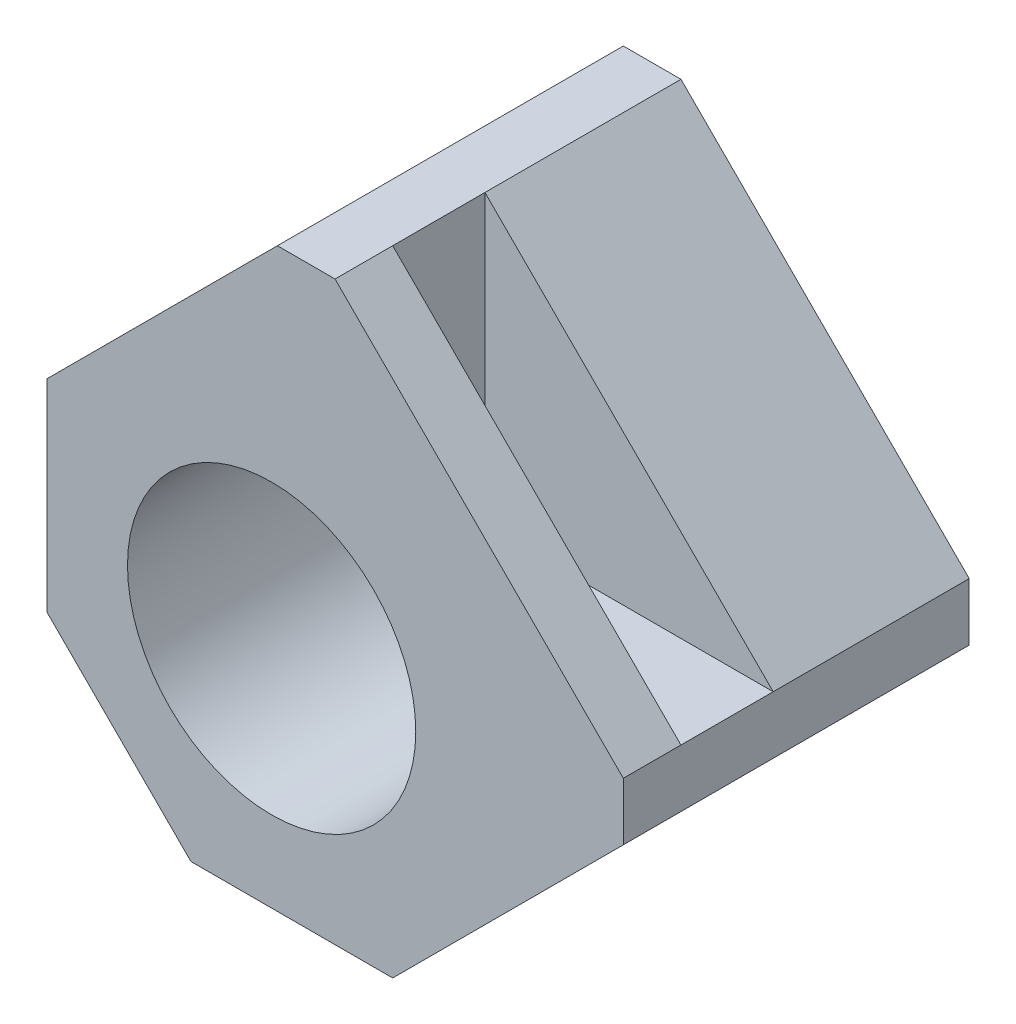
ISO-10303-21;
HEADER;
FILE_DESCRIPTION(('STEP AP214'),'2;1');
FILE_NAME('part.step','',(''),(''),'','','');
FILE_SCHEMA(('AUTOMOTIVE_DESIGN { 1 0 10303 214 1 1 1 1 }'));
ENDSEC;
DATA;
#1=APPLICATION_CONTEXT('core data for automotive mechanical design processes');
#2=APPLICATION_PROTOCOL_DEFINITION('international standard','automotive_design',2000,#1);
#3=PRODUCT_CONTEXT('',#1,'mechanical');
#4=PRODUCT('Part','Part','',(#3));
#5=PRODUCT_RELATED_PRODUCT_CATEGORY('part','',(#4));
#6=PRODUCT_DEFINITION_FORMATION('','',#4);
#7=PRODUCT_DEFINITION_CONTEXT('part definition',#1,'design');
#8=PRODUCT_DEFINITION('design','',#6,#7);
#9=PRODUCT_DEFINITION_SHAPE('','',#8);
#10=(LENGTH_UNIT() NAMED_UNIT(*) SI_UNIT(.MILLI.,.METRE.));
#11=(NAMED_UNIT(*) PLANE_ANGLE_UNIT() SI_UNIT($,.RADIAN.));
#12=(NAMED_UNIT(*) SI_UNIT($,.STERADIAN.) SOLID_ANGLE_UNIT());
#13=UNCERTAINTY_MEASURE_WITH_UNIT(LENGTH_MEASURE(1.E-05),#10,'distance_accuracy_value','');
#14=(GEOMETRIC_REPRESENTATION_CONTEXT(3) GLOBAL_UNCERTAINTY_ASSIGNED_CONTEXT((#13)) GLOBAL_UNIT_ASSIGNED_CONTEXT((#10,
#11,#12)) REPRESENTATION_CONTEXT('',''));
#15=CARTESIAN_POINT('',(0.,0.,0.));
#16=DIRECTION('',(0.,0.,1.));
#17=DIRECTION('',(1.,0.,0.));
#18=AXIS2_PLACEMENT_3D('',#15,#16,#17);
#19=CARTESIAN_POINT('',(7.80000000000001,7.79999999999997,12.));
#20=DIRECTION('',(0.,0.,-1.));
#21=DIRECTION('',(-1.,0.,0.));
#22=AXIS2_PLACEMENT_3D('',#19,#20,#21);
#23=CYLINDRICAL_SURFACE('',#22,2.2);
#24=CARTESIAN_POINT('',(7.80000000000001,7.79999999999997,1.5));
#25=DIRECTION('',(0.,0.,1.));
#26=DIRECTION('',(1.,0.,0.));
#27=AXIS2_PLACEMENT_3D('',#24,#25,#26);
#28=CIRCLE('',#27,2.2);
#29=CARTESIAN_POINT('',(10.,7.79999999999997,1.5));
#30=VERTEX_POINT('',#29);
#31=EDGE_CURVE('E194',#30,#30,#28,.F.);
#32=ORIENTED_EDGE('',*,*,#31,.F.);
#33=EDGE_LOOP('',(#32));
#34=FACE_BOUND('',#33,.T.);
#35=CARTESIAN_POINT('',(7.80000000000001,7.79999999999997,0.5));
#36=DIRECTION('',(0.,0.,-1.));
#37=DIRECTION('',(-1.,0.,0.));
#38=AXIS2_PLACEMENT_3D('',#35,#36,#37);
#39=CIRCLE('',#38,2.2);
#40=CARTESIAN_POINT('',(5.6,7.79999999999997,0.5));
#41=VERTEX_POINT('',#40);
#42=EDGE_CURVE('E37',#41,#41,#39,.F.);
#43=ORIENTED_EDGE('',*,*,#42,.F.);
#44=EDGE_LOOP('',(#43));
#45=FACE_BOUND('',#44,.T.);
#46=ADVANCED_FACE('F33',(#34,#45),#23,.F.);
#47=CARTESIAN_POINT('',(10.,20.,12.));
#48=DIRECTION('',(-0.707106781186549,-0.707106781186546,0.));
#49=DIRECTION('',(0.,0.,-1.));
#50=AXIS2_PLACEMENT_3D('',#47,#48,#49);
#51=PLANE('',#50);
#52=DIRECTION('',(0.,0.,-1.));
#53=VECTOR('',#52,1.);
#54=CARTESIAN_POINT('',(10.,20.,12.));
#55=LINE('',#54,#53);
#56=CARTESIAN_POINT('',(10.,20.,6.8));
#57=VERTEX_POINT('',#56);
#58=CARTESIAN_POINT('',(10.,20.,0.));
#59=VERTEX_POINT('',#58);
#60=EDGE_CURVE('E175',#57,#59,#55,.T.);
#61=ORIENTED_EDGE('',*,*,#60,.F.);
#62=DIRECTION('',(-0.707106781186546,0.707106781186549,0.));
#63=VECTOR('',#62,1.);
#64=CARTESIAN_POINT('',(20.,9.99999999999997,6.8));
#65=LINE('',#64,#63);
#66=CARTESIAN_POINT('',(20.,9.99999999999997,6.8));
#67=VERTEX_POINT('',#66);
#68=EDGE_CURVE('E149',#67,#57,#65,.T.);
#69=ORIENTED_EDGE('',*,*,#68,.F.);
#70=DIRECTION('',(0.,0.,1.));
#71=VECTOR('',#70,1.);
#72=CARTESIAN_POINT('',(20.,9.99999999999997,12.));
#73=LINE('',#72,#71);
#74=CARTESIAN_POINT('',(20.,9.99999999999997,0.));
#75=VERTEX_POINT('',#74);
#76=EDGE_CURVE('E190',#75,#67,#73,.T.);
#77=ORIENTED_EDGE('',*,*,#76,.F.);
#78=DIRECTION('',(-0.707106781186546,0.707106781186549,0.));
#79=VECTOR('',#78,1.);
#80=CARTESIAN_POINT('',(15.,15.,0.));
#81=LINE('',#80,#79);
#82=EDGE_CURVE('E186',#59,#75,#81,.F.);
#83=ORIENTED_EDGE('',*,*,#82,.F.);
#84=EDGE_LOOP('',(#61,#69,#77,#83));
#85=FACE_BOUND('',#84,.T.);
#86=ADVANCED_FACE('F283',(#85),#51,.F.);
#87=CARTESIAN_POINT('',(0.,0.,12.));
#88=DIRECTION('',(1.,0.,0.));
#89=DIRECTION('',(0.,0.,-1.));
#90=AXIS2_PLACEMENT_3D('',#87,#88,#89);
#91=PLANE('',#90);
#92=DIRECTION('',(0.,-1.,0.));
#93=VECTOR('',#92,1.);
#94=CARTESIAN_POINT('',(0.,0.,12.));
#95=LINE('',#94,#93);
#96=CARTESIAN_POINT('',(0.,12.,12.));
#97=VERTEX_POINT('',#96);
#98=CARTESIAN_POINT('',(0.,5.00000000000002,12.));
#99=VERTEX_POINT('',#98);
#100=EDGE_CURVE('E165',#97,#99,#95,.T.);
#101=ORIENTED_EDGE('',*,*,#100,.F.);
#102=DIRECTION('',(0.,0.,-1.));
#103=VECTOR('',#102,1.);
#104=CARTESIAN_POINT('',(0.,12.,12.));
#105=LINE('',#104,#103);
#106=CARTESIAN_POINT('',(0.,12.,0.));
#107=VERTEX_POINT('',#106);
#108=EDGE_CURVE('E42',#97,#107,#105,.T.);
#109=ORIENTED_EDGE('',*,*,#108,.T.);
#110=DIRECTION('',(0.,-1.,0.));
#111=VECTOR('',#110,1.);
#112=CARTESIAN_POINT('',(0.,0.,0.));
#113=LINE('',#112,#111);
#114=CARTESIAN_POINT('',(0.,5.00000000000002,0.));
#115=VERTEX_POINT('',#114);
#116=EDGE_CURVE('E161',#107,#115,#113,.T.);
#117=ORIENTED_EDGE('',*,*,#116,.T.);
#118=DIRECTION('',(0.,0.,1.));
#119=VECTOR('',#118,1.);
#120=CARTESIAN_POINT('',(0.,5.00000000000002,12.));
#121=LINE('',#120,#119);
#122=EDGE_CURVE('E203',#115,#99,#121,.T.);
#123=ORIENTED_EDGE('',*,*,#122,.T.);
#124=EDGE_LOOP('',(#101,#109,#117,#123));
#125=FACE_BOUND('',#124,.T.);
#126=ADVANCED_FACE('F224',(#125),#91,.F.);
#127=CARTESIAN_POINT('',(0.,0.,12.));
#128=DIRECTION('',(0.,1.,0.));
#129=DIRECTION('',(0.,0.,1.));
#130=AXIS2_PLACEMENT_3D('',#127,#128,#129);
#131=PLANE('',#130);
#132=DIRECTION('',(1.,0.,0.));
#133=VECTOR('',#132,1.);
#134=CARTESIAN_POINT('',(0.,0.,0.));
#135=LINE('',#134,#133);
#136=CARTESIAN_POINT('',(5.,0.,0.));
#137=VERTEX_POINT('',#136);
#138=CARTESIAN_POINT('',(12.,0.,0.));
#139=VERTEX_POINT('',#138);
#140=EDGE_CURVE('E177',#137,#139,#135,.T.);
#141=ORIENTED_EDGE('',*,*,#140,.T.);
#142=DIRECTION('',(0.,0.,1.));
#143=VECTOR('',#142,1.);
#144=CARTESIAN_POINT('',(12.,0.,12.));
#145=LINE('',#144,#143);
#146=CARTESIAN_POINT('',(12.,0.,12.));
#147=VERTEX_POINT('',#146);
#148=EDGE_CURVE('E215',#139,#147,#145,.T.);
#149=ORIENTED_EDGE('',*,*,#148,.T.);
#150=DIRECTION('',(1.,0.,0.));
#151=VECTOR('',#150,1.);
#152=CARTESIAN_POINT('',(0.,0.,12.));
#153=LINE('',#152,#151);
#154=CARTESIAN_POINT('',(5.,0.,12.));
#155=VERTEX_POINT('',#154);
#156=EDGE_CURVE('E167',#155,#147,#153,.T.);
#157=ORIENTED_EDGE('',*,*,#156,.F.);
#158=DIRECTION('',(0.,0.,-1.));
#159=VECTOR('',#158,1.);
#160=CARTESIAN_POINT('',(5.,0.,12.));
#161=LINE('',#160,#159);
#162=EDGE_CURVE('E133',#155,#137,#161,.T.);
#163=ORIENTED_EDGE('',*,*,#162,.T.);
#164=EDGE_LOOP('',(#141,#149,#157,#163));
#165=FACE_BOUND('',#164,.T.);
#166=ADVANCED_FACE('F240',(#165),#131,.F.);
#167=CARTESIAN_POINT('',(20.,0.,12.));
#168=DIRECTION('',(-1.,0.,0.));
#169=DIRECTION('',(0.,0.,1.));
#170=AXIS2_PLACEMENT_3D('',#167,#168,#169);
#171=PLANE('',#170);
#172=DIRECTION('',(0.,1.,0.));
#173=VECTOR('',#172,1.);
#174=CARTESIAN_POINT('',(20.,0.,12.));
#175=LINE('',#174,#173);
#176=CARTESIAN_POINT('',(20.,8.,12.));
#177=VERTEX_POINT('',#176);
#178=CARTESIAN_POINT('',(20.,9.99999999999997,12.));
#179=VERTEX_POINT('',#178);
#180=EDGE_CURVE('E171',#177,#179,#175,.T.);
#181=ORIENTED_EDGE('',*,*,#180,.F.);
#182=DIRECTION('',(0.,0.,-1.));
#183=VECTOR('',#182,1.);
#184=CARTESIAN_POINT('',(20.,8.,12.));
#185=LINE('',#184,#183);
#186=CARTESIAN_POINT('',(20.,8.,0.));
#187=VERTEX_POINT('',#186);
#188=EDGE_CURVE('E208',#177,#187,#185,.T.);
#189=ORIENTED_EDGE('',*,*,#188,.T.);
#190=DIRECTION('',(0.,1.,0.));
#191=VECTOR('',#190,1.);
#192=CARTESIAN_POINT('',(20.,0.,0.));
#193=LINE('',#192,#191);
#194=EDGE_CURVE('E180',#187,#75,#193,.T.);
#195=ORIENTED_EDGE('',*,*,#194,.T.);
#196=ORIENTED_EDGE('',*,*,#76,.T.);
#197=DIRECTION('',(0.,0.,1.));
#198=VECTOR('',#197,1.);
#199=CARTESIAN_POINT('',(20.,9.99999999999997,6.8));
#200=LINE('',#199,#198);
#201=CARTESIAN_POINT('',(20.,9.99999999999997,10.));
#202=VERTEX_POINT('',#201);
#203=EDGE_CURVE('E158',#67,#202,#200,.T.);
#204=ORIENTED_EDGE('',*,*,#203,.T.);
#205=EDGE_CURVE('E189',#202,#179,#73,.T.);
#206=ORIENTED_EDGE('',*,*,#205,.T.);
#207=EDGE_LOOP('',(#181,#189,#195,#196,#204,#206));
#208=FACE_BOUND('',#207,.T.);
#209=ADVANCED_FACE('F248',(#208),#171,.F.);
#210=CARTESIAN_POINT('',(0.,20.,12.));
#211=DIRECTION('',(0.,-1.,0.));
#212=DIRECTION('',(0.,0.,-1.));
#213=AXIS2_PLACEMENT_3D('',#210,#211,#212);
#214=PLANE('',#213);
#215=DIRECTION('',(-1.,0.,0.));
#216=VECTOR('',#215,1.);
#217=CARTESIAN_POINT('',(0.,20.,0.));
#218=LINE('',#217,#216);
#219=CARTESIAN_POINT('',(8.00000000000003,20.,0.));
#220=VERTEX_POINT('',#219);
#221=EDGE_CURVE('E168',#59,#220,#218,.T.);
#222=ORIENTED_EDGE('',*,*,#221,.T.);
#223=DIRECTION('',(0.,0.,1.));
#224=VECTOR('',#223,1.);
#225=CARTESIAN_POINT('',(8.00000000000003,20.,12.));
#226=LINE('',#225,#224);
#227=CARTESIAN_POINT('',(8.00000000000003,20.,12.));
#228=VERTEX_POINT('',#227);
#229=EDGE_CURVE('E11',#220,#228,#226,.T.);
#230=ORIENTED_EDGE('',*,*,#229,.T.);
#231=DIRECTION('',(-1.,0.,0.));
#232=VECTOR('',#231,1.);
#233=CARTESIAN_POINT('',(0.,20.,12.));
#234=LINE('',#233,#232);
#235=CARTESIAN_POINT('',(10.,20.,12.));
#236=VERTEX_POINT('',#235);
#237=EDGE_CURVE('E173',#236,#228,#234,.T.);
#238=ORIENTED_EDGE('',*,*,#237,.F.);
#239=CARTESIAN_POINT('',(10.,20.,10.));
#240=VERTEX_POINT('',#239);
#241=EDGE_CURVE('E183',#236,#240,#55,.T.);
#242=ORIENTED_EDGE('',*,*,#241,.T.);
#243=DIRECTION('',(0.,0.,1.));
#244=VECTOR('',#243,1.);
#245=CARTESIAN_POINT('',(10.,20.,6.8));
#246=LINE('',#245,#244);
#247=EDGE_CURVE('E162',#57,#240,#246,.T.);
#248=ORIENTED_EDGE('',*,*,#247,.F.);
#249=ORIENTED_EDGE('',*,*,#60,.T.);
#250=EDGE_LOOP('',(#222,#230,#238,#242,#248,#249));
#251=FACE_BOUND('',#250,.T.);
#252=ADVANCED_FACE('F253',(#251),#214,.F.);
#253=CARTESIAN_POINT('',(0.,0.,12.));
#254=DIRECTION('',(0.,0.,-1.));
#255=DIRECTION('',(-1.,0.,0.));
#256=AXIS2_PLACEMENT_3D('',#253,#254,#255);
#257=PLANE('',#256);
#258=CARTESIAN_POINT('',(7.80000000000001,7.79999999999997,12.));
#259=DIRECTION('',(0.,0.,1.));
#260=DIRECTION('',(1.,0.,0.));
#261=AXIS2_PLACEMENT_3D('',#258,#259,#260);
#262=CIRCLE('',#261,5.);
#263=CARTESIAN_POINT('',(12.8,7.79999999999997,12.));
#264=VERTEX_POINT('',#263);
#265=EDGE_CURVE('E265',#264,#264,#262,.T.);
#266=ORIENTED_EDGE('',*,*,#265,.F.);
#267=EDGE_LOOP('',(#266));
#268=FACE_BOUND('',#267,.T.);
#269=ORIENTED_EDGE('',*,*,#156,.T.);
#270=DIRECTION('',(-0.707106781186549,-0.707106781186546,0.));
#271=VECTOR('',#270,1.);
#272=CARTESIAN_POINT('',(20.,8.,12.));
#273=LINE('',#272,#271);
#274=EDGE_CURVE('E218',#147,#177,#273,.F.);
#275=ORIENTED_EDGE('',*,*,#274,.T.);
#276=ORIENTED_EDGE('',*,*,#180,.T.);
#277=DIRECTION('',(0.707106781186546,-0.707106781186549,0.));
#278=VECTOR('',#277,1.);
#279=CARTESIAN_POINT('',(10.,20.,12.));
#280=LINE('',#279,#278);
#281=EDGE_CURVE('E134',#179,#236,#280,.F.);
#282=ORIENTED_EDGE('',*,*,#281,.T.);
#283=ORIENTED_EDGE('',*,*,#237,.T.);
#284=DIRECTION('',(0.707106781186549,0.707106781186546,0.));
#285=VECTOR('',#284,1.);
#286=CARTESIAN_POINT('',(0.,12.,12.));
#287=LINE('',#286,#285);
#288=EDGE_CURVE('E54',#228,#97,#287,.F.);
#289=ORIENTED_EDGE('',*,*,#288,.T.);
#290=ORIENTED_EDGE('',*,*,#100,.T.);
#291=DIRECTION('',(-0.707106781186546,0.707106781186549,0.));
#292=VECTOR('',#291,1.);
#293=CARTESIAN_POINT('',(5.,0.,12.));
#294=LINE('',#293,#292);
#295=EDGE_CURVE('E206',#99,#155,#294,.F.);
#296=ORIENTED_EDGE('',*,*,#295,.T.);
#297=EDGE_LOOP('',(#269,#275,#276,#282,#283,#289,#290,#296));
#298=FACE_BOUND('',#297,.T.);
#299=ADVANCED_FACE('F237',(#268,#298),#257,.F.);
#300=CARTESIAN_POINT('',(0.,0.,0.));
#301=DIRECTION('',(0.,0.,-1.));
#302=DIRECTION('',(-1.,0.,0.));
#303=AXIS2_PLACEMENT_3D('',#300,#301,#302);
#304=PLANE('',#303);
#305=CARTESIAN_POINT('',(7.80000000000001,7.79999999999997,0.));
#306=DIRECTION('',(0.,0.,-1.));
#307=DIRECTION('',(-1.,0.,0.));
#308=AXIS2_PLACEMENT_3D('',#305,#306,#307);
#309=CIRCLE('',#308,6.);
#310=CARTESIAN_POINT('',(1.8,7.79999999999997,0.));
#311=VERTEX_POINT('',#310);
#312=EDGE_CURVE('E270',#311,#311,#309,.T.);
#313=ORIENTED_EDGE('',*,*,#312,.F.);
#314=EDGE_LOOP('',(#313));
#315=FACE_BOUND('',#314,.T.);
#316=ORIENTED_EDGE('',*,*,#194,.F.);
#317=DIRECTION('',(0.707106781186549,0.707106781186546,0.));
#318=VECTOR('',#317,1.);
#319=CARTESIAN_POINT('',(5.99999999999997,-5.99999999999999,0.));
#320=LINE('',#319,#318);
#321=EDGE_CURVE('E213',#187,#139,#320,.F.);
#322=ORIENTED_EDGE('',*,*,#321,.T.);
#323=ORIENTED_EDGE('',*,*,#140,.F.);
#324=DIRECTION('',(0.707106781186546,-0.707106781186549,0.));
#325=VECTOR('',#324,1.);
#326=CARTESIAN_POINT('',(2.50000000000001,2.5,0.));
#327=LINE('',#326,#325);
#328=EDGE_CURVE('E200',#137,#115,#327,.F.);
#329=ORIENTED_EDGE('',*,*,#328,.T.);
#330=ORIENTED_EDGE('',*,*,#116,.F.);
#331=DIRECTION('',(-0.707106781186549,-0.707106781186546,0.));
#332=VECTOR('',#331,1.);
#333=CARTESIAN_POINT('',(-6.,6.00000000000002,0.));
#334=LINE('',#333,#332);
#335=EDGE_CURVE('E211',#107,#220,#334,.F.);
#336=ORIENTED_EDGE('',*,*,#335,.T.);
#337=ORIENTED_EDGE('',*,*,#221,.F.);
#338=ORIENTED_EDGE('',*,*,#82,.T.);
#339=EDGE_LOOP('',(#316,#322,#323,#329,#330,#336,#337,#338));
#340=FACE_BOUND('',#339,.T.);
#341=ADVANCED_FACE('F228',(#315,#340),#304,.T.);
#342=DIRECTION('',(-0.707106781186546,0.707106781186549,0.));
#343=VECTOR('',#342,1.);
#344=CARTESIAN_POINT('',(20.,9.99999999999997,10.));
#345=LINE('',#344,#343);
#346=EDGE_CURVE('E147',#202,#240,#345,.T.);
#347=ORIENTED_EDGE('',*,*,#346,.T.);
#348=ORIENTED_EDGE('',*,*,#241,.F.);
#349=ORIENTED_EDGE('',*,*,#281,.F.);
#350=ORIENTED_EDGE('',*,*,#205,.F.);
#351=EDGE_LOOP('',(#347,#348,#349,#350));
#352=FACE_BOUND('',#351,.T.);
#353=ADVANCED_FACE('F252',(#352),#51,.F.);
#354=CARTESIAN_POINT('',(10.,9.99999999999997,6.8));
#355=DIRECTION('',(0.,-1.,0.));
#356=DIRECTION('',(0.,0.,-1.));
#357=AXIS2_PLACEMENT_3D('',#354,#355,#356);
#358=PLANE('',#357);
#359=DIRECTION('',(1.,0.,0.));
#360=VECTOR('',#359,1.);
#361=CARTESIAN_POINT('',(10.,9.99999999999997,6.8));
#362=LINE('',#361,#360);
#363=CARTESIAN_POINT('',(12.2899888641287,9.99999999999997,6.8));
#364=VERTEX_POINT('',#363);
#365=EDGE_CURVE('E142',#364,#67,#362,.T.);
#366=ORIENTED_EDGE('',*,*,#365,.F.);
#367=DIRECTION('',(0.,0.,1.));
#368=VECTOR('',#367,1.);
#369=CARTESIAN_POINT('',(12.2899888641287,9.99999999999997,1.5));
#370=LINE('',#369,#368);
#371=CARTESIAN_POINT('',(12.2899888641287,9.99999999999997,10.));
#372=VERTEX_POINT('',#371);
#373=EDGE_CURVE('E126',#364,#372,#370,.T.);
#374=ORIENTED_EDGE('',*,*,#373,.T.);
#375=DIRECTION('',(1.,0.,0.));
#376=VECTOR('',#375,1.);
#377=CARTESIAN_POINT('',(10.,9.99999999999997,10.));
#378=LINE('',#377,#376);
#379=EDGE_CURVE('E140',#372,#202,#378,.T.);
#380=ORIENTED_EDGE('',*,*,#379,.T.);
#381=ORIENTED_EDGE('',*,*,#203,.F.);
#382=EDGE_LOOP('',(#366,#374,#380,#381));
#383=FACE_BOUND('',#382,.T.);
#384=ADVANCED_FACE('F138',(#383),#358,.F.);
#385=CARTESIAN_POINT('',(10.,20.,6.8));
#386=DIRECTION('',(-1.,0.,0.));
#387=DIRECTION('',(0.,0.,1.));
#388=AXIS2_PLACEMENT_3D('',#385,#386,#387);
#389=PLANE('',#388);
#390=DIRECTION('',(0.,-1.,0.));
#391=VECTOR('',#390,1.);
#392=CARTESIAN_POINT('',(10.,20.,10.));
#393=LINE('',#392,#391);
#394=CARTESIAN_POINT('',(10.,12.2899888641287,10.));
#395=VERTEX_POINT('',#394);
#396=EDGE_CURVE('E150',#240,#395,#393,.T.);
#397=ORIENTED_EDGE('',*,*,#396,.T.);
#398=DIRECTION('',(0.,0.,1.));
#399=VECTOR('',#398,1.);
#400=CARTESIAN_POINT('',(10.,12.2899888641287,1.5));
#401=LINE('',#400,#399);
#402=CARTESIAN_POINT('',(10.,12.2899888641287,6.8));
#403=VERTEX_POINT('',#402);
#404=EDGE_CURVE('E129',#395,#403,#401,.F.);
#405=ORIENTED_EDGE('',*,*,#404,.T.);
#406=DIRECTION('',(0.,-1.,0.));
#407=VECTOR('',#406,1.);
#408=CARTESIAN_POINT('',(10.,20.,6.8));
#409=LINE('',#408,#407);
#410=EDGE_CURVE('E153',#57,#403,#409,.T.);
#411=ORIENTED_EDGE('',*,*,#410,.F.);
#412=ORIENTED_EDGE('',*,*,#247,.T.);
#413=EDGE_LOOP('',(#397,#405,#411,#412));
#414=FACE_BOUND('',#413,.T.);
#415=ADVANCED_FACE('F258',(#414),#389,.F.);
#416=CARTESIAN_POINT('',(0.,0.,6.8));
#417=DIRECTION('',(0.,0.,1.));
#418=DIRECTION('',(1.,0.,0.));
#419=AXIS2_PLACEMENT_3D('',#416,#417,#418);
#420=PLANE('',#419);
#421=CARTESIAN_POINT('',(7.80000000000001,7.79999999999997,6.8));
#422=DIRECTION('',(0.,0.,1.));
#423=DIRECTION('',(1.,0.,0.));
#424=AXIS2_PLACEMENT_3D('',#421,#422,#423);
#425=CIRCLE('',#424,5.);
#426=EDGE_CURVE('E143',#364,#403,#425,.T.);
#427=ORIENTED_EDGE('',*,*,#426,.F.);
#428=ORIENTED_EDGE('',*,*,#365,.T.);
#429=ORIENTED_EDGE('',*,*,#68,.T.);
#430=ORIENTED_EDGE('',*,*,#410,.T.);
#431=EDGE_LOOP('',(#427,#428,#429,#430));
#432=FACE_BOUND('',#431,.T.);
#433=ADVANCED_FACE('F297',(#432),#420,.T.);
#434=CARTESIAN_POINT('',(0.,0.,10.));
#435=DIRECTION('',(0.,0.,1.));
#436=DIRECTION('',(1.,0.,0.));
#437=AXIS2_PLACEMENT_3D('',#434,#435,#436);
#438=PLANE('',#437);
#439=ORIENTED_EDGE('',*,*,#379,.F.);
#440=CARTESIAN_POINT('',(7.80000000000001,7.79999999999997,10.));
#441=DIRECTION('',(0.,0.,1.));
#442=DIRECTION('',(1.,0.,0.));
#443=AXIS2_PLACEMENT_3D('',#440,#441,#442);
#444=CIRCLE('',#443,5.);
#445=EDGE_CURVE('E122',#372,#395,#444,.T.);
#446=ORIENTED_EDGE('',*,*,#445,.T.);
#447=ORIENTED_EDGE('',*,*,#396,.F.);
#448=ORIENTED_EDGE('',*,*,#346,.F.);
#449=EDGE_LOOP('',(#439,#446,#447,#448));
#450=FACE_BOUND('',#449,.T.);
#451=ADVANCED_FACE('F145',(#450),#438,.F.);
#452=CARTESIAN_POINT('',(7.80000000000001,7.79999999999997,1.5));
#453=DIRECTION('',(0.,0.,1.));
#454=DIRECTION('',(1.,0.,0.));
#455=AXIS2_PLACEMENT_3D('',#452,#453,#454);
#456=PLANE('',#455);
#457=CARTESIAN_POINT('',(7.80000000000001,7.79999999999997,1.5));
#458=DIRECTION('',(0.,0.,1.));
#459=DIRECTION('',(1.,0.,0.));
#460=AXIS2_PLACEMENT_3D('',#457,#458,#459);
#461=CIRCLE('',#460,5.);
#462=CARTESIAN_POINT('',(12.8,7.79999999999997,1.5));
#463=VERTEX_POINT('',#462);
#464=EDGE_CURVE('E196',#463,#463,#461,.T.);
#465=ORIENTED_EDGE('',*,*,#464,.T.);
#466=EDGE_LOOP('',(#465));
#467=FACE_BOUND('',#466,.T.);
#468=ORIENTED_EDGE('',*,*,#31,.T.);
#469=EDGE_LOOP('',(#468));
#470=FACE_BOUND('',#469,.T.);
#471=ADVANCED_FACE('F303',(#467,#470),#456,.T.);
#472=CARTESIAN_POINT('',(7.80000000000001,7.79999999999997,1.5));
#473=DIRECTION('',(0.,0.,1.));
#474=DIRECTION('',(1.,0.,0.));
#475=AXIS2_PLACEMENT_3D('',#472,#473,#474);
#476=CYLINDRICAL_SURFACE('',#475,5.);
#477=ORIENTED_EDGE('',*,*,#426,.T.);
#478=ORIENTED_EDGE('',*,*,#404,.F.);
#479=ORIENTED_EDGE('',*,*,#445,.F.);
#480=ORIENTED_EDGE('',*,*,#373,.F.);
#481=EDGE_LOOP('',(#477,#478,#479,#480));
#482=FACE_BOUND('',#481,.T.);
#483=ORIENTED_EDGE('',*,*,#464,.F.);
#484=EDGE_LOOP('',(#483));
#485=FACE_BOUND('',#484,.T.);
#486=ORIENTED_EDGE('',*,*,#265,.T.);
#487=EDGE_LOOP('',(#486));
#488=FACE_BOUND('',#487,.T.);
#489=ADVANCED_FACE('F124',(#482,#485,#488),#476,.F.);
#490=CARTESIAN_POINT('',(5.,0.,12.));
#491=DIRECTION('',(0.707106781186549,0.707106781186546,0.));
#492=DIRECTION('',(0.,0.,-1.));
#493=AXIS2_PLACEMENT_3D('',#490,#491,#492);
#494=PLANE('',#493);
#495=ORIENTED_EDGE('',*,*,#295,.F.);
#496=ORIENTED_EDGE('',*,*,#122,.F.);
#497=ORIENTED_EDGE('',*,*,#328,.F.);
#498=ORIENTED_EDGE('',*,*,#162,.F.);
#499=EDGE_LOOP('',(#495,#496,#497,#498));
#500=FACE_BOUND('',#499,.T.);
#501=ADVANCED_FACE('F235',(#500),#494,.F.);
#502=CARTESIAN_POINT('',(20.,8.,12.));
#503=DIRECTION('',(-0.707106781186546,0.707106781186549,0.));
#504=DIRECTION('',(0.,0.,-1.));
#505=AXIS2_PLACEMENT_3D('',#502,#503,#504);
#506=PLANE('',#505);
#507=ORIENTED_EDGE('',*,*,#274,.F.);
#508=ORIENTED_EDGE('',*,*,#148,.F.);
#509=ORIENTED_EDGE('',*,*,#321,.F.);
#510=ORIENTED_EDGE('',*,*,#188,.F.);
#511=EDGE_LOOP('',(#507,#508,#509,#510));
#512=FACE_BOUND('',#511,.T.);
#513=ADVANCED_FACE('F243',(#512),#506,.F.);
#514=CARTESIAN_POINT('',(0.,12.,12.));
#515=DIRECTION('',(0.707106781186546,-0.707106781186549,0.));
#516=DIRECTION('',(0.,0.,-1.));
#517=AXIS2_PLACEMENT_3D('',#514,#515,#516);
#518=PLANE('',#517);
#519=ORIENTED_EDGE('',*,*,#288,.F.);
#520=ORIENTED_EDGE('',*,*,#229,.F.);
#521=ORIENTED_EDGE('',*,*,#335,.F.);
#522=ORIENTED_EDGE('',*,*,#108,.F.);
#523=EDGE_LOOP('',(#519,#520,#521,#522));
#524=FACE_BOUND('',#523,.T.);
#525=ADVANCED_FACE('F35',(#524),#518,.F.);
#526=CARTESIAN_POINT('',(7.80000000000001,7.79999999999997,0.5));
#527=DIRECTION('',(0.,0.,-1.));
#528=DIRECTION('',(-1.,0.,0.));
#529=AXIS2_PLACEMENT_3D('',#526,#527,#528);
#530=PLANE('',#529);
#531=CARTESIAN_POINT('',(7.80000000000001,7.79999999999997,0.5));
#532=DIRECTION('',(0.,0.,-1.));
#533=DIRECTION('',(-1.,0.,0.));
#534=AXIS2_PLACEMENT_3D('',#531,#532,#533);
#535=CIRCLE('',#534,6.);
#536=CARTESIAN_POINT('',(1.8,7.79999999999997,0.5));
#537=VERTEX_POINT('',#536);
#538=EDGE_CURVE('E273',#537,#537,#535,.T.);
#539=ORIENTED_EDGE('',*,*,#538,.T.);
#540=EDGE_LOOP('',(#539));
#541=FACE_BOUND('',#540,.T.);
#542=ORIENTED_EDGE('',*,*,#42,.T.);
#543=EDGE_LOOP('',(#542));
#544=FACE_BOUND('',#543,.T.);
#545=ADVANCED_FACE('F280',(#541,#544),#530,.T.);
#546=CARTESIAN_POINT('',(7.80000000000001,7.79999999999997,0.5));
#547=DIRECTION('',(0.,0.,-1.));
#548=DIRECTION('',(-1.,0.,0.));
#549=AXIS2_PLACEMENT_3D('',#546,#547,#548);
#550=CYLINDRICAL_SURFACE('',#549,6.);
#551=ORIENTED_EDGE('',*,*,#538,.F.);
#552=EDGE_LOOP('',(#551));
#553=FACE_BOUND('',#552,.T.);
#554=ORIENTED_EDGE('',*,*,#312,.T.);
#555=EDGE_LOOP('',(#554));
#556=FACE_BOUND('',#555,.T.);
#557=ADVANCED_FACE('F330',(#553,#556),#550,.F.);
#558=CLOSED_SHELL('',(#46,#86,#126,#166,#209,#252,#299,#341,#353,#384,#415,#433,#451,#471,#489,
#501,#513,#525,#545,#557));
#559=MANIFOLD_SOLID_BREP('B2',#558);
#560=ADVANCED_BREP_SHAPE_REPRESENTATION('',(#18,#559),#14);
#561=SHAPE_DEFINITION_REPRESENTATION(#9,#560);
ENDSEC;
END-ISO-10303-21;
